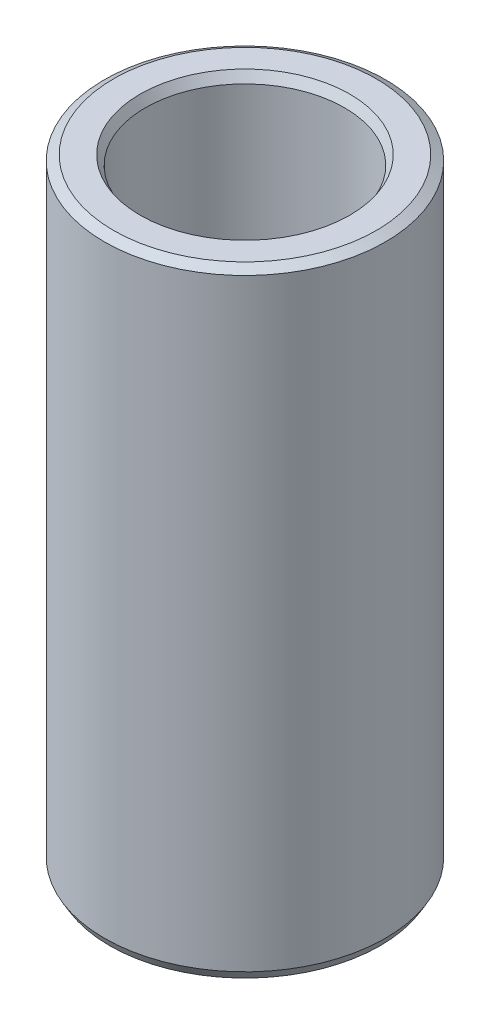
ISO-10303-21;
HEADER;
FILE_DESCRIPTION(('STEP AP214'),'2;1');
FILE_NAME('part.step','',(''),(''),'','','');
FILE_SCHEMA(('AUTOMOTIVE_DESIGN { 1 0 10303 214 1 1 1 1 }'));
ENDSEC;
DATA;
#1=APPLICATION_CONTEXT('core data for automotive mechanical design processes');
#2=APPLICATION_PROTOCOL_DEFINITION('international standard','automotive_design',2000,#1);
#3=PRODUCT_CONTEXT('',#1,'mechanical');
#4=PRODUCT('Part','Part','',(#3));
#5=PRODUCT_RELATED_PRODUCT_CATEGORY('part','',(#4));
#6=PRODUCT_DEFINITION_FORMATION('','',#4);
#7=PRODUCT_DEFINITION_CONTEXT('part definition',#1,'design');
#8=PRODUCT_DEFINITION('design','',#6,#7);
#9=PRODUCT_DEFINITION_SHAPE('','',#8);
#10=(LENGTH_UNIT() NAMED_UNIT(*) SI_UNIT(.MILLI.,.METRE.));
#11=(NAMED_UNIT(*) PLANE_ANGLE_UNIT() SI_UNIT($,.RADIAN.));
#12=(NAMED_UNIT(*) SI_UNIT($,.STERADIAN.) SOLID_ANGLE_UNIT());
#13=UNCERTAINTY_MEASURE_WITH_UNIT(LENGTH_MEASURE(1.E-05),#10,'distance_accuracy_value','');
#14=(GEOMETRIC_REPRESENTATION_CONTEXT(3) GLOBAL_UNCERTAINTY_ASSIGNED_CONTEXT((#13)) GLOBAL_UNIT_ASSIGNED_CONTEXT((#10,
#11,#12)) REPRESENTATION_CONTEXT('',''));
#15=CARTESIAN_POINT('',(0.,0.,0.));
#16=DIRECTION('',(0.,0.,1.));
#17=DIRECTION('',(1.,0.,0.));
#18=AXIS2_PLACEMENT_3D('',#15,#16,#17);
#19=CARTESIAN_POINT('',(0.,131.800180526022,0.));
#20=DIRECTION('',(0.,-1.,0.));
#21=DIRECTION('',(0.,0.,-1.));
#22=AXIS2_PLACEMENT_3D('',#19,#20,#21);
#23=CYLINDRICAL_SURFACE('',#22,30.);
#24=CARTESIAN_POINT('',(0.,1.95579794771822,0.));
#25=DIRECTION('',(0.,1.,0.));
#26=DIRECTION('',(0.,0.,1.));
#27=AXIS2_PLACEMENT_3D('',#24,#25,#26);
#28=CIRCLE('',#27,30.);
#29=CARTESIAN_POINT('',(0.,1.95579794771822,30.));
#30=VERTEX_POINT('',#29);
#31=EDGE_CURVE('E10',#30,#30,#28,.T.);
#32=ORIENTED_EDGE('',*,*,#31,.T.);
#33=EDGE_LOOP('',(#32));
#34=FACE_BOUND('',#33,.T.);
#35=CARTESIAN_POINT('',(0.,130.671000054427,0.));
#36=DIRECTION('',(0.,1.,0.));
#37=DIRECTION('',(0.,0.,1.));
#38=AXIS2_PLACEMENT_3D('',#35,#36,#37);
#39=CIRCLE('',#38,30.);
#40=CARTESIAN_POINT('',(0.,130.671000054427,30.));
#41=VERTEX_POINT('',#40);
#42=EDGE_CURVE('E50',#41,#41,#39,.F.);
#43=ORIENTED_EDGE('',*,*,#42,.T.);
#44=EDGE_LOOP('',(#43));
#45=FACE_BOUND('',#44,.T.);
#46=ADVANCED_FACE('F39',(#34,#45),#23,.T.);
#47=CARTESIAN_POINT('',(0.,131.800180526022,0.));
#48=DIRECTION('',(0.,1.,0.));
#49=DIRECTION('',(0.,0.,1.));
#50=AXIS2_PLACEMENT_3D('',#47,#48,#49);
#51=PLANE('',#50);
#52=CARTESIAN_POINT('',(0.,131.800180526022,0.));
#53=DIRECTION('',(0.,1.,0.));
#54=DIRECTION('',(0.,0.,1.));
#55=AXIS2_PLACEMENT_3D('',#52,#53,#54);
#56=CIRCLE('',#55,22.3903033435374);
#57=CARTESIAN_POINT('',(0.,131.800180526022,22.3903033435374));
#58=VERTEX_POINT('',#57);
#59=EDGE_CURVE('E58',#58,#58,#56,.F.);
#60=ORIENTED_EDGE('',*,*,#59,.T.);
#61=EDGE_LOOP('',(#60));
#62=FACE_BOUND('',#61,.T.);
#63=CARTESIAN_POINT('',(0.,131.800180526022,0.));
#64=DIRECTION('',(0.,1.,0.));
#65=DIRECTION('',(0.,0.,1.));
#66=AXIS2_PLACEMENT_3D('',#63,#64,#65);
#67=CIRCLE('',#66,28.0442020522818);
#68=CARTESIAN_POINT('',(0.,131.800180526022,28.0442020522818));
#69=VERTEX_POINT('',#68);
#70=EDGE_CURVE('E61',#69,#69,#67,.T.);
#71=ORIENTED_EDGE('',*,*,#70,.T.);
#72=EDGE_LOOP('',(#71));
#73=FACE_BOUND('',#72,.T.);
#74=ADVANCED_FACE('F88',(#62,#73),#51,.T.);
#75=CARTESIAN_POINT('',(0.,0.,0.));
#76=DIRECTION('',(0.,1.,0.));
#77=DIRECTION('',(0.,0.,1.));
#78=AXIS2_PLACEMENT_3D('',#75,#76,#77);
#79=PLANE('',#78);
#80=CARTESIAN_POINT('',(0.,0.,0.));
#81=DIRECTION('',(0.,1.,0.));
#82=DIRECTION('',(0.,0.,1.));
#83=AXIS2_PLACEMENT_3D('',#80,#81,#82);
#84=CIRCLE('',#83,23.21692081966);
#85=CARTESIAN_POINT('',(0.,0.,23.21692081966));
#86=VERTEX_POINT('',#85);
#87=EDGE_CURVE('E51',#86,#86,#84,.T.);
#88=ORIENTED_EDGE('',*,*,#87,.T.);
#89=EDGE_LOOP('',(#88));
#90=FACE_BOUND('',#89,.T.);
#91=CARTESIAN_POINT('',(0.,0.,0.));
#92=DIRECTION('',(0.,1.,0.));
#93=DIRECTION('',(0.,0.,1.));
#94=AXIS2_PLACEMENT_3D('',#91,#92,#93);
#95=CIRCLE('',#94,28.8708195284044);
#96=CARTESIAN_POINT('',(0.,0.,28.8708195284044));
#97=VERTEX_POINT('',#96);
#98=EDGE_CURVE('E54',#97,#97,#95,.F.);
#99=ORIENTED_EDGE('',*,*,#98,.T.);
#100=EDGE_LOOP('',(#99));
#101=FACE_BOUND('',#100,.T.);
#102=ADVANCED_FACE('F83',(#90,#101),#79,.F.);
#103=CARTESIAN_POINT('',(0.,131.800180526022,0.));
#104=DIRECTION('',(0.,-1.,0.));
#105=DIRECTION('',(0.,0.,-1.));
#106=AXIS2_PLACEMENT_3D('',#103,#104,#105);
#107=CYLINDRICAL_SURFACE('',#106,21.2611228719418);
#108=CARTESIAN_POINT('',(0.,129.844382578304,0.));
#109=DIRECTION('',(0.,1.,0.));
#110=DIRECTION('',(0.,0.,1.));
#111=AXIS2_PLACEMENT_3D('',#108,#109,#110);
#112=CIRCLE('',#111,21.2611228719418);
#113=CARTESIAN_POINT('',(0.,129.844382578304,21.2611228719418));
#114=VERTEX_POINT('',#113);
#115=EDGE_CURVE('E67',#114,#114,#112,.T.);
#116=ORIENTED_EDGE('',*,*,#115,.T.);
#117=EDGE_LOOP('',(#116));
#118=FACE_BOUND('',#117,.T.);
#119=CARTESIAN_POINT('',(0.,1.12918047159566,0.));
#120=DIRECTION('',(0.,1.,0.));
#121=DIRECTION('',(0.,0.,1.));
#122=AXIS2_PLACEMENT_3D('',#119,#120,#121);
#123=CIRCLE('',#122,21.2611228719418);
#124=CARTESIAN_POINT('',(0.,1.12918047159566,21.2611228719418));
#125=VERTEX_POINT('',#124);
#126=EDGE_CURVE('E69',#125,#125,#123,.F.);
#127=ORIENTED_EDGE('',*,*,#126,.T.);
#128=EDGE_LOOP('',(#127));
#129=FACE_BOUND('',#128,.T.);
#130=ADVANCED_FACE('F71',(#118,#129),#107,.F.);
#131=CARTESIAN_POINT('',(0.,129.844382578304,0.));
#132=DIRECTION('',(0.,1.,0.));
#133=DIRECTION('',(0.,0.,1.));
#134=AXIS2_PLACEMENT_3D('',#131,#132,#133);
#135=CONICAL_SURFACE('',#134,21.2611228719418,0.523598775598301);
#136=ORIENTED_EDGE('',*,*,#59,.F.);
#137=EDGE_LOOP('',(#136));
#138=FACE_BOUND('',#137,.T.);
#139=ORIENTED_EDGE('',*,*,#115,.F.);
#140=EDGE_LOOP('',(#139));
#141=FACE_BOUND('',#140,.T.);
#142=ADVANCED_FACE('F77',(#138,#141),#135,.F.);
#143=CARTESIAN_POINT('',(0.,0.,0.));
#144=DIRECTION('',(0.,-1.,0.));
#145=DIRECTION('',(0.,0.,-1.));
#146=AXIS2_PLACEMENT_3D('',#143,#144,#145);
#147=CONICAL_SURFACE('',#146,23.21692081966,1.04719755119658);
#148=ORIENTED_EDGE('',*,*,#126,.F.);
#149=EDGE_LOOP('',(#148));
#150=FACE_BOUND('',#149,.T.);
#151=ORIENTED_EDGE('',*,*,#87,.F.);
#152=EDGE_LOOP('',(#151));
#153=FACE_BOUND('',#152,.T.);
#154=ADVANCED_FACE('F73',(#150,#153),#147,.F.);
#155=CARTESIAN_POINT('',(0.,1.95579794771822,0.));
#156=DIRECTION('',(0.,1.,0.));
#157=DIRECTION('',(0.,0.,1.));
#158=AXIS2_PLACEMENT_3D('',#155,#156,#157);
#159=CONICAL_SURFACE('',#158,30.,0.523598775598301);
#160=ORIENTED_EDGE('',*,*,#98,.F.);
#161=EDGE_LOOP('',(#160));
#162=FACE_BOUND('',#161,.T.);
#163=ORIENTED_EDGE('',*,*,#31,.F.);
#164=EDGE_LOOP('',(#163));
#165=FACE_BOUND('',#164,.T.);
#166=ADVANCED_FACE('F76',(#162,#165),#159,.T.);
#167=CARTESIAN_POINT('',(0.,131.800180526022,0.));
#168=DIRECTION('',(0.,-1.,0.));
#169=DIRECTION('',(0.,0.,-1.));
#170=AXIS2_PLACEMENT_3D('',#167,#168,#169);
#171=CONICAL_SURFACE('',#170,28.0442020522818,1.04719755119659);
#172=ORIENTED_EDGE('',*,*,#42,.F.);
#173=EDGE_LOOP('',(#172));
#174=FACE_BOUND('',#173,.T.);
#175=ORIENTED_EDGE('',*,*,#70,.F.);
#176=EDGE_LOOP('',(#175));
#177=FACE_BOUND('',#176,.T.);
#178=ADVANCED_FACE('F45',(#174,#177),#171,.T.);
#179=CLOSED_SHELL('',(#46,#74,#102,#130,#142,#154,#166,#178));
#180=MANIFOLD_SOLID_BREP('B2',#179);
#181=ADVANCED_BREP_SHAPE_REPRESENTATION('',(#18,#180),#14);
#182=SHAPE_DEFINITION_REPRESENTATION(#9,#181);
ENDSEC;
END-ISO-10303-21;
